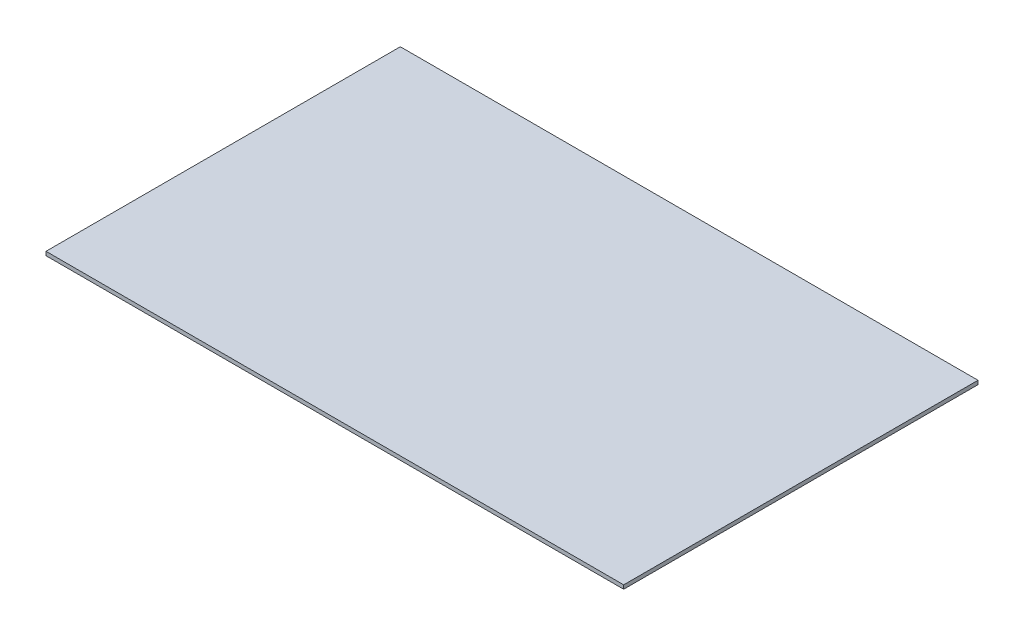
ISO-10303-21;
HEADER;
FILE_DESCRIPTION(('STEP AP214'),'2;1');
FILE_NAME('part.step','',(''),(''),'','','');
FILE_SCHEMA(('AUTOMOTIVE_DESIGN { 1 0 10303 214 1 1 1 1 }'));
ENDSEC;
DATA;
#1=APPLICATION_CONTEXT('core data for automotive mechanical design processes');
#2=APPLICATION_PROTOCOL_DEFINITION('international standard','automotive_design',2000,#1);
#3=PRODUCT_CONTEXT('',#1,'mechanical');
#4=PRODUCT('Part','Part','',(#3));
#5=PRODUCT_RELATED_PRODUCT_CATEGORY('part','',(#4));
#6=PRODUCT_DEFINITION_FORMATION('','',#4);
#7=PRODUCT_DEFINITION_CONTEXT('part definition',#1,'design');
#8=PRODUCT_DEFINITION('design','',#6,#7);
#9=PRODUCT_DEFINITION_SHAPE('','',#8);
#10=(LENGTH_UNIT() NAMED_UNIT(*) SI_UNIT(.MILLI.,.METRE.));
#11=(NAMED_UNIT(*) PLANE_ANGLE_UNIT() SI_UNIT($,.RADIAN.));
#12=(NAMED_UNIT(*) SI_UNIT($,.STERADIAN.) SOLID_ANGLE_UNIT());
#13=UNCERTAINTY_MEASURE_WITH_UNIT(LENGTH_MEASURE(1.E-05),#10,'distance_accuracy_value','');
#14=(GEOMETRIC_REPRESENTATION_CONTEXT(3) GLOBAL_UNCERTAINTY_ASSIGNED_CONTEXT((#13)) GLOBAL_UNIT_ASSIGNED_CONTEXT((#10,
#11,#12)) REPRESENTATION_CONTEXT('',''));
#15=CARTESIAN_POINT('',(0.,0.,0.));
#16=DIRECTION('',(0.,0.,1.));
#17=DIRECTION('',(1.,0.,0.));
#18=AXIS2_PLACEMENT_3D('',#15,#16,#17);
#19=CARTESIAN_POINT('',(0.,5.,0.));
#20=DIRECTION('',(-1.,0.,0.));
#21=DIRECTION('',(0.,0.,1.));
#22=AXIS2_PLACEMENT_3D('',#19,#20,#21);
#23=PLANE('',#22);
#24=DIRECTION('',(0.,0.,-1.));
#25=VECTOR('',#24,1.);
#26=CARTESIAN_POINT('',(0.,0.,0.));
#27=LINE('',#26,#25);
#28=CARTESIAN_POINT('',(0.,0.,0.));
#29=VERTEX_POINT('',#28);
#30=CARTESIAN_POINT('',(0.,0.,-460.));
#31=VERTEX_POINT('',#30);
#32=EDGE_CURVE('E98',#29,#31,#27,.T.);
#33=ORIENTED_EDGE('',*,*,#32,.T.);
#34=DIRECTION('',(0.,-1.,0.));
#35=VECTOR('',#34,1.);
#36=CARTESIAN_POINT('',(0.,5.,-460.));
#37=LINE('',#36,#35);
#38=CARTESIAN_POINT('',(0.,5.,-460.));
#39=VERTEX_POINT('',#38);
#40=EDGE_CURVE('E11',#39,#31,#37,.T.);
#41=ORIENTED_EDGE('',*,*,#40,.F.);
#42=DIRECTION('',(0.,0.,-1.));
#43=VECTOR('',#42,1.);
#44=CARTESIAN_POINT('',(0.,5.,0.));
#45=LINE('',#44,#43);
#46=CARTESIAN_POINT('',(0.,5.,0.));
#47=VERTEX_POINT('',#46);
#48=EDGE_CURVE('E86',#47,#39,#45,.T.);
#49=ORIENTED_EDGE('',*,*,#48,.F.);
#50=DIRECTION('',(0.,-1.,0.));
#51=VECTOR('',#50,1.);
#52=CARTESIAN_POINT('',(0.,5.,0.));
#53=LINE('',#52,#51);
#54=EDGE_CURVE('E94',#47,#29,#53,.T.);
#55=ORIENTED_EDGE('',*,*,#54,.T.);
#56=EDGE_LOOP('',(#33,#41,#49,#55));
#57=FACE_BOUND('',#56,.T.);
#58=ADVANCED_FACE('F35',(#57),#23,.F.);
#59=CARTESIAN_POINT('',(0.,5.,-460.));
#60=DIRECTION('',(0.,0.,1.));
#61=DIRECTION('',(1.,0.,0.));
#62=AXIS2_PLACEMENT_3D('',#59,#60,#61);
#63=PLANE('',#62);
#64=DIRECTION('',(-1.,0.,0.));
#65=VECTOR('',#64,1.);
#66=CARTESIAN_POINT('',(0.,0.,-460.));
#67=LINE('',#66,#65);
#68=CARTESIAN_POINT('',(-750.,0.,-460.));
#69=VERTEX_POINT('',#68);
#70=EDGE_CURVE('E90',#31,#69,#67,.T.);
#71=ORIENTED_EDGE('',*,*,#70,.T.);
#72=DIRECTION('',(0.,-1.,0.));
#73=VECTOR('',#72,1.);
#74=CARTESIAN_POINT('',(-750.,5.,-460.));
#75=LINE('',#74,#73);
#76=CARTESIAN_POINT('',(-750.,5.,-460.));
#77=VERTEX_POINT('',#76);
#78=EDGE_CURVE('E43',#77,#69,#75,.T.);
#79=ORIENTED_EDGE('',*,*,#78,.F.);
#80=DIRECTION('',(-1.,0.,0.));
#81=VECTOR('',#80,1.);
#82=CARTESIAN_POINT('',(0.,5.,-460.));
#83=LINE('',#82,#81);
#84=EDGE_CURVE('E81',#39,#77,#83,.T.);
#85=ORIENTED_EDGE('',*,*,#84,.F.);
#86=ORIENTED_EDGE('',*,*,#40,.T.);
#87=EDGE_LOOP('',(#71,#79,#85,#86));
#88=FACE_BOUND('',#87,.T.);
#89=ADVANCED_FACE('F89',(#88),#63,.F.);
#90=CARTESIAN_POINT('',(-750.,5.,0.));
#91=DIRECTION('',(1.,0.,0.));
#92=DIRECTION('',(0.,0.,-1.));
#93=AXIS2_PLACEMENT_3D('',#90,#91,#92);
#94=PLANE('',#93);
#95=DIRECTION('',(0.,0.,1.));
#96=VECTOR('',#95,1.);
#97=CARTESIAN_POINT('',(-750.,0.,0.));
#98=LINE('',#97,#96);
#99=CARTESIAN_POINT('',(-750.,0.,0.));
#100=VERTEX_POINT('',#99);
#101=EDGE_CURVE('E68',#69,#100,#98,.T.);
#102=ORIENTED_EDGE('',*,*,#101,.T.);
#103=DIRECTION('',(0.,-1.,0.));
#104=VECTOR('',#103,1.);
#105=CARTESIAN_POINT('',(-750.,5.,0.));
#106=LINE('',#105,#104);
#107=CARTESIAN_POINT('',(-750.,5.,0.));
#108=VERTEX_POINT('',#107);
#109=EDGE_CURVE('E91',#108,#100,#106,.T.);
#110=ORIENTED_EDGE('',*,*,#109,.F.);
#111=DIRECTION('',(0.,0.,1.));
#112=VECTOR('',#111,1.);
#113=CARTESIAN_POINT('',(-750.,5.,0.));
#114=LINE('',#113,#112);
#115=EDGE_CURVE('E84',#77,#108,#114,.T.);
#116=ORIENTED_EDGE('',*,*,#115,.F.);
#117=ORIENTED_EDGE('',*,*,#78,.T.);
#118=EDGE_LOOP('',(#102,#110,#116,#117));
#119=FACE_BOUND('',#118,.T.);
#120=ADVANCED_FACE('F92',(#119),#94,.F.);
#121=CARTESIAN_POINT('',(0.,5.,0.));
#122=DIRECTION('',(0.,0.,-1.));
#123=DIRECTION('',(-1.,0.,0.));
#124=AXIS2_PLACEMENT_3D('',#121,#122,#123);
#125=PLANE('',#124);
#126=DIRECTION('',(1.,0.,0.));
#127=VECTOR('',#126,1.);
#128=CARTESIAN_POINT('',(0.,0.,0.));
#129=LINE('',#128,#127);
#130=EDGE_CURVE('E74',#100,#29,#129,.T.);
#131=ORIENTED_EDGE('',*,*,#130,.T.);
#132=ORIENTED_EDGE('',*,*,#54,.F.);
#133=DIRECTION('',(1.,0.,0.));
#134=VECTOR('',#133,1.);
#135=CARTESIAN_POINT('',(0.,5.,0.));
#136=LINE('',#135,#134);
#137=EDGE_CURVE('E51',#108,#47,#136,.T.);
#138=ORIENTED_EDGE('',*,*,#137,.F.);
#139=ORIENTED_EDGE('',*,*,#109,.T.);
#140=EDGE_LOOP('',(#131,#132,#138,#139));
#141=FACE_BOUND('',#140,.T.);
#142=ADVANCED_FACE('F105',(#141),#125,.F.);
#143=CARTESIAN_POINT('',(0.,5.,0.));
#144=DIRECTION('',(0.,1.,0.));
#145=DIRECTION('',(0.,0.,1.));
#146=AXIS2_PLACEMENT_3D('',#143,#144,#145);
#147=PLANE('',#146);
#148=ORIENTED_EDGE('',*,*,#48,.T.);
#149=ORIENTED_EDGE('',*,*,#84,.T.);
#150=ORIENTED_EDGE('',*,*,#115,.T.);
#151=ORIENTED_EDGE('',*,*,#137,.T.);
#152=EDGE_LOOP('',(#148,#149,#150,#151));
#153=FACE_BOUND('',#152,.T.);
#154=ADVANCED_FACE('F82',(#153),#147,.T.);
#155=CARTESIAN_POINT('',(0.,0.,0.));
#156=DIRECTION('',(0.,1.,0.));
#157=DIRECTION('',(0.,0.,1.));
#158=AXIS2_PLACEMENT_3D('',#155,#156,#157);
#159=PLANE('',#158);
#160=ORIENTED_EDGE('',*,*,#32,.F.);
#161=ORIENTED_EDGE('',*,*,#130,.F.);
#162=ORIENTED_EDGE('',*,*,#101,.F.);
#163=ORIENTED_EDGE('',*,*,#70,.F.);
#164=EDGE_LOOP('',(#160,#161,#162,#163));
#165=FACE_BOUND('',#164,.T.);
#166=ADVANCED_FACE('F108',(#165),#159,.F.);
#167=CLOSED_SHELL('',(#58,#89,#120,#142,#154,#166));
#168=MANIFOLD_SOLID_BREP('B2',#167);
#169=ADVANCED_BREP_SHAPE_REPRESENTATION('',(#18,#168),#14);
#170=SHAPE_DEFINITION_REPRESENTATION(#9,#169);
ENDSEC;
END-ISO-10303-21;
